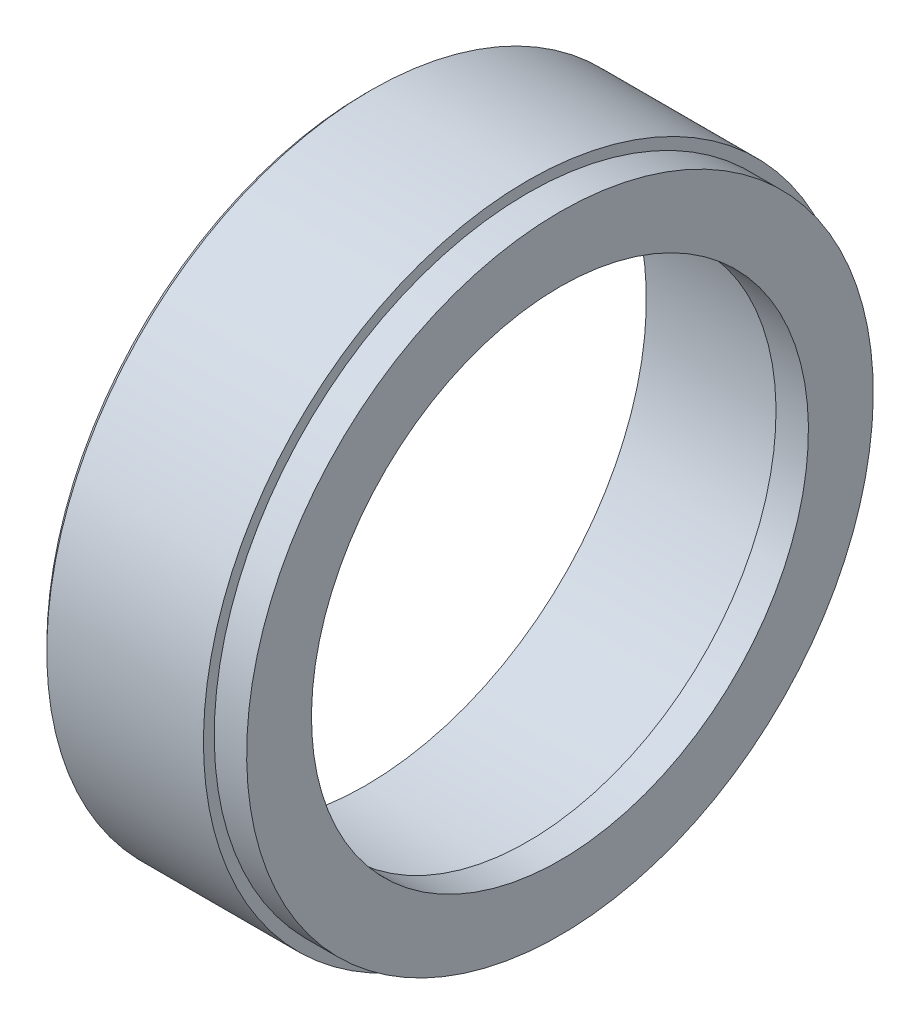
ISO-10303-21;
HEADER;
FILE_DESCRIPTION(('STEP AP214'),'2;1');
FILE_NAME('part.step','',(''),(''),'','','');
FILE_SCHEMA(('AUTOMOTIVE_DESIGN { 1 0 10303 214 1 1 1 1 }'));
ENDSEC;
DATA;
#1=APPLICATION_CONTEXT('core data for automotive mechanical design processes');
#2=APPLICATION_PROTOCOL_DEFINITION('international standard','automotive_design',2000,#1);
#3=PRODUCT_CONTEXT('',#1,'mechanical');
#4=PRODUCT('Part','Part','',(#3));
#5=PRODUCT_RELATED_PRODUCT_CATEGORY('part','',(#4));
#6=PRODUCT_DEFINITION_FORMATION('','',#4);
#7=PRODUCT_DEFINITION_CONTEXT('part definition',#1,'design');
#8=PRODUCT_DEFINITION('design','',#6,#7);
#9=PRODUCT_DEFINITION_SHAPE('','',#8);
#10=(LENGTH_UNIT() NAMED_UNIT(*) SI_UNIT(.MILLI.,.METRE.));
#11=(NAMED_UNIT(*) PLANE_ANGLE_UNIT() SI_UNIT($,.RADIAN.));
#12=(NAMED_UNIT(*) SI_UNIT($,.STERADIAN.) SOLID_ANGLE_UNIT());
#13=UNCERTAINTY_MEASURE_WITH_UNIT(LENGTH_MEASURE(1.E-05),#10,'distance_accuracy_value','');
#14=(GEOMETRIC_REPRESENTATION_CONTEXT(3) GLOBAL_UNCERTAINTY_ASSIGNED_CONTEXT((#13)) GLOBAL_UNIT_ASSIGNED_CONTEXT((#10,
#11,#12)) REPRESENTATION_CONTEXT('',''));
#15=CARTESIAN_POINT('',(0.,0.,0.));
#16=DIRECTION('',(0.,0.,1.));
#17=DIRECTION('',(1.,0.,0.));
#18=AXIS2_PLACEMENT_3D('',#15,#16,#17);
#19=CARTESIAN_POINT('',(-98.0499999999999,29.,2.08166817117217E-13));
#20=DIRECTION('',(1.,0.,0.));
#21=DIRECTION('',(0.,1.,0.));
#22=AXIS2_PLACEMENT_3D('',#19,#20,#21);
#23=PLANE('',#22);
#24=CARTESIAN_POINT('',(-98.0499999999999,0.,1.94289029309402E-13));
#25=DIRECTION('',(1.,0.,0.));
#26=DIRECTION('',(0.,1.,0.));
#27=AXIS2_PLACEMENT_3D('',#24,#25,#26);
#28=CIRCLE('',#27,29.);
#29=CARTESIAN_POINT('',(-98.0499999999999,29.,1.94289029309402E-13));
#30=VERTEX_POINT('',#29);
#31=EDGE_CURVE('E83',#30,#30,#28,.T.);
#32=ORIENTED_EDGE('',*,*,#31,.T.);
#33=EDGE_LOOP('',(#32));
#34=FACE_BOUND('',#33,.T.);
#35=CARTESIAN_POINT('',(-98.0499999999999,0.,1.94289029309402E-13));
#36=DIRECTION('',(1.,0.,0.));
#37=DIRECTION('',(0.,1.,0.));
#38=AXIS2_PLACEMENT_3D('',#35,#36,#37);
#39=CIRCLE('',#38,23.);
#40=CARTESIAN_POINT('',(-98.0499999999999,23.,1.94289029309402E-13));
#41=VERTEX_POINT('',#40);
#42=EDGE_CURVE('E62',#41,#41,#39,.T.);
#43=ORIENTED_EDGE('',*,*,#42,.F.);
#44=EDGE_LOOP('',(#43));
#45=FACE_BOUND('',#44,.T.);
#46=ADVANCED_FACE('F51',(#34,#45),#23,.T.);
#47=CARTESIAN_POINT('',(-108.55,0.,1.80411241501588E-13));
#48=DIRECTION('',(1.,0.,0.));
#49=DIRECTION('',(0.,1.,0.));
#50=AXIS2_PLACEMENT_3D('',#47,#48,#49);
#51=CYLINDRICAL_SURFACE('',#50,23.);
#52=ORIENTED_EDGE('',*,*,#42,.T.);
#53=EDGE_LOOP('',(#52));
#54=FACE_BOUND('',#53,.T.);
#55=CARTESIAN_POINT('',(-101.05,0.,1.94289029309402E-13));
#56=DIRECTION('',(1.,0.,0.));
#57=DIRECTION('',(0.,1.,0.));
#58=AXIS2_PLACEMENT_3D('',#55,#56,#57);
#59=CIRCLE('',#58,23.);
#60=CARTESIAN_POINT('',(-101.05,23.,1.94289029309402E-13));
#61=VERTEX_POINT('',#60);
#62=EDGE_CURVE('E66',#61,#61,#59,.T.);
#63=ORIENTED_EDGE('',*,*,#62,.F.);
#64=EDGE_LOOP('',(#63));
#65=FACE_BOUND('',#64,.T.);
#66=ADVANCED_FACE('F103',(#54,#65),#51,.F.);
#67=CARTESIAN_POINT('',(-101.05,23.,2.77555756156289E-13));
#68=DIRECTION('',(-1.,0.,0.));
#69=DIRECTION('',(0.,-1.,0.));
#70=AXIS2_PLACEMENT_3D('',#67,#68,#69);
#71=PLANE('',#70);
#72=ORIENTED_EDGE('',*,*,#62,.T.);
#73=EDGE_LOOP('',(#72));
#74=FACE_BOUND('',#73,.T.);
#75=CARTESIAN_POINT('',(-101.05,0.,1.94289029309402E-13));
#76=DIRECTION('',(1.,0.,0.));
#77=DIRECTION('',(0.,1.,0.));
#78=AXIS2_PLACEMENT_3D('',#75,#76,#77);
#79=CIRCLE('',#78,26.);
#80=CARTESIAN_POINT('',(-101.05,26.,1.94289029309402E-13));
#81=VERTEX_POINT('',#80);
#82=EDGE_CURVE('E71',#81,#81,#79,.T.);
#83=ORIENTED_EDGE('',*,*,#82,.F.);
#84=EDGE_LOOP('',(#83));
#85=FACE_BOUND('',#84,.T.);
#86=ADVANCED_FACE('F107',(#74,#85),#71,.T.);
#87=CARTESIAN_POINT('',(-108.55,0.,1.80411241501588E-13));
#88=DIRECTION('',(1.,0.,0.));
#89=DIRECTION('',(0.,1.,0.));
#90=AXIS2_PLACEMENT_3D('',#87,#88,#89);
#91=CYLINDRICAL_SURFACE('',#90,26.);
#92=ORIENTED_EDGE('',*,*,#82,.T.);
#93=EDGE_LOOP('',(#92));
#94=FACE_BOUND('',#93,.T.);
#95=CARTESIAN_POINT('',(-116.05,0.,1.66533453693773E-13));
#96=DIRECTION('',(1.,0.,0.));
#97=DIRECTION('',(0.,1.,0.));
#98=AXIS2_PLACEMENT_3D('',#95,#96,#97);
#99=CIRCLE('',#98,26.);
#100=CARTESIAN_POINT('',(-116.05,26.,1.66533453693773E-13));
#101=VERTEX_POINT('',#100);
#102=EDGE_CURVE('E74',#101,#101,#99,.T.);
#103=ORIENTED_EDGE('',*,*,#102,.F.);
#104=EDGE_LOOP('',(#103));
#105=FACE_BOUND('',#104,.T.);
#106=ADVANCED_FACE('F113',(#94,#105),#91,.F.);
#107=CARTESIAN_POINT('',(-116.05,26.,2.08166817117217E-13));
#108=DIRECTION('',(-1.,0.,0.));
#109=DIRECTION('',(0.,-1.,0.));
#110=AXIS2_PLACEMENT_3D('',#107,#108,#109);
#111=PLANE('',#110);
#112=CARTESIAN_POINT('',(-116.05,0.,1.66533453693773E-13));
#113=DIRECTION('',(-1.,0.,0.));
#114=DIRECTION('',(0.,-1.,0.));
#115=AXIS2_PLACEMENT_3D('',#112,#113,#114);
#116=CIRCLE('',#115,29.5);
#117=CARTESIAN_POINT('',(-116.05,-29.5000000000001,1.66533453693773E-13));
#118=VERTEX_POINT('',#117);
#119=EDGE_CURVE('E12',#118,#118,#116,.T.);
#120=ORIENTED_EDGE('',*,*,#119,.T.);
#121=EDGE_LOOP('',(#120));
#122=FACE_BOUND('',#121,.T.);
#123=ORIENTED_EDGE('',*,*,#102,.T.);
#124=EDGE_LOOP('',(#123));
#125=FACE_BOUND('',#124,.T.);
#126=ADVANCED_FACE('F117',(#122,#125),#111,.T.);
#127=CARTESIAN_POINT('',(-108.55,0.,1.80411241501588E-13));
#128=DIRECTION('',(1.,0.,0.));
#129=DIRECTION('',(0.,1.,0.));
#130=AXIS2_PLACEMENT_3D('',#127,#128,#129);
#131=CYLINDRICAL_SURFACE('',#130,30.);
#132=CARTESIAN_POINT('',(-115.55,0.,1.66533453693773E-13));
#133=DIRECTION('',(-1.,0.,0.));
#134=DIRECTION('',(0.,-1.,0.));
#135=AXIS2_PLACEMENT_3D('',#132,#133,#134);
#136=CIRCLE('',#135,30.);
#137=CARTESIAN_POINT('',(-115.55,-30.0000000000001,1.66533453693773E-13));
#138=VERTEX_POINT('',#137);
#139=EDGE_CURVE('E58',#138,#138,#136,.F.);
#140=ORIENTED_EDGE('',*,*,#139,.T.);
#141=EDGE_LOOP('',(#140));
#142=FACE_BOUND('',#141,.T.);
#143=CARTESIAN_POINT('',(-101.05,0.,1.94289029309402E-13));
#144=DIRECTION('',(1.,0.,0.));
#145=DIRECTION('',(0.,1.,0.));
#146=AXIS2_PLACEMENT_3D('',#143,#144,#145);
#147=CIRCLE('',#146,30.);
#148=CARTESIAN_POINT('',(-101.05,30.,1.94289029309402E-13));
#149=VERTEX_POINT('',#148);
#150=EDGE_CURVE('E77',#149,#149,#147,.T.);
#151=ORIENTED_EDGE('',*,*,#150,.F.);
#152=EDGE_LOOP('',(#151));
#153=FACE_BOUND('',#152,.T.);
#154=ADVANCED_FACE('F99',(#142,#153),#131,.T.);
#155=CARTESIAN_POINT('',(-101.05,30.0000000000001,0.));
#156=DIRECTION('',(1.,0.,0.));
#157=DIRECTION('',(0.,1.,0.));
#158=AXIS2_PLACEMENT_3D('',#155,#156,#157);
#159=PLANE('',#158);
#160=ORIENTED_EDGE('',*,*,#150,.T.);
#161=EDGE_LOOP('',(#160));
#162=FACE_BOUND('',#161,.T.);
#163=CARTESIAN_POINT('',(-101.05,0.,1.94289029309402E-13));
#164=DIRECTION('',(1.,0.,0.));
#165=DIRECTION('',(0.,1.,0.));
#166=AXIS2_PLACEMENT_3D('',#163,#164,#165);
#167=CIRCLE('',#166,29.);
#168=CARTESIAN_POINT('',(-101.05,29.,1.94289029309402E-13));
#169=VERTEX_POINT('',#168);
#170=EDGE_CURVE('E80',#169,#169,#167,.T.);
#171=ORIENTED_EDGE('',*,*,#170,.F.);
#172=EDGE_LOOP('',(#171));
#173=FACE_BOUND('',#172,.T.);
#174=ADVANCED_FACE('F91',(#162,#173),#159,.T.);
#175=CARTESIAN_POINT('',(-108.55,0.,1.80411241501588E-13));
#176=DIRECTION('',(1.,0.,0.));
#177=DIRECTION('',(0.,1.,0.));
#178=AXIS2_PLACEMENT_3D('',#175,#176,#177);
#179=CYLINDRICAL_SURFACE('',#178,29.);
#180=ORIENTED_EDGE('',*,*,#170,.T.);
#181=EDGE_LOOP('',(#180));
#182=FACE_BOUND('',#181,.T.);
#183=ORIENTED_EDGE('',*,*,#31,.F.);
#184=EDGE_LOOP('',(#183));
#185=FACE_BOUND('',#184,.T.);
#186=ADVANCED_FACE('F89',(#182,#185),#179,.T.);
#187=CARTESIAN_POINT('',(-115.55,0.,1.66533453693773E-13));
#188=DIRECTION('',(1.,0.,0.));
#189=DIRECTION('',(0.,1.,0.));
#190=AXIS2_PLACEMENT_3D('',#187,#188,#189);
#191=CONICAL_SURFACE('',#190,30.,0.785398163397428);
#192=ORIENTED_EDGE('',*,*,#119,.F.);
#193=EDGE_LOOP('',(#192));
#194=FACE_BOUND('',#193,.T.);
#195=ORIENTED_EDGE('',*,*,#139,.F.);
#196=EDGE_LOOP('',(#195));
#197=FACE_BOUND('',#196,.T.);
#198=ADVANCED_FACE('F53',(#194,#197),#191,.T.);
#199=CLOSED_SHELL('',(#46,#66,#86,#106,#126,#154,#174,#186,#198));
#200=MANIFOLD_SOLID_BREP('B2',#199);
#201=ADVANCED_BREP_SHAPE_REPRESENTATION('',(#18,#200),#14);
#202=SHAPE_DEFINITION_REPRESENTATION(#9,#201);
ENDSEC;
END-ISO-10303-21;
